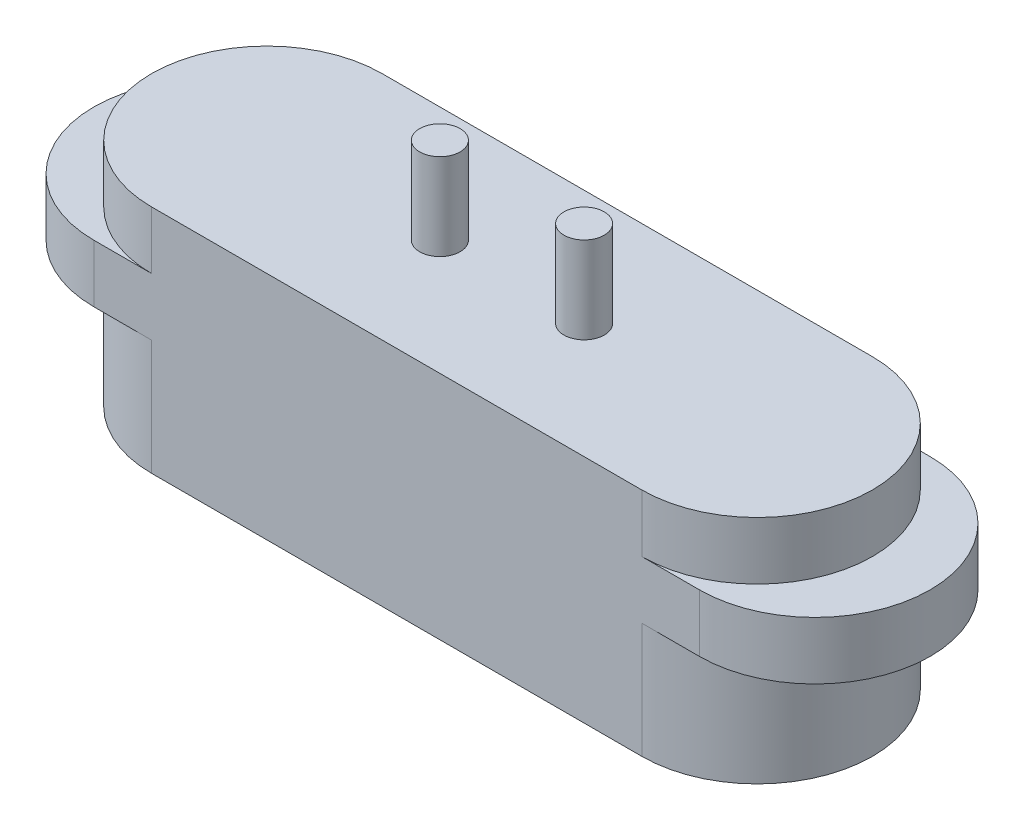
ISO-10303-21;
HEADER;
FILE_DESCRIPTION(('STEP AP214'),'2;1');
FILE_NAME('part.step','',(''),(''),'','','');
FILE_SCHEMA(('AUTOMOTIVE_DESIGN { 1 0 10303 214 1 1 1 1 }'));
ENDSEC;
DATA;
#1=APPLICATION_CONTEXT('core data for automotive mechanical design processes');
#2=APPLICATION_PROTOCOL_DEFINITION('international standard','automotive_design',2000,#1);
#3=PRODUCT_CONTEXT('',#1,'mechanical');
#4=PRODUCT('Part','Part','',(#3));
#5=PRODUCT_RELATED_PRODUCT_CATEGORY('part','',(#4));
#6=PRODUCT_DEFINITION_FORMATION('','',#4);
#7=PRODUCT_DEFINITION_CONTEXT('part definition',#1,'design');
#8=PRODUCT_DEFINITION('design','',#6,#7);
#9=PRODUCT_DEFINITION_SHAPE('','',#8);
#10=(LENGTH_UNIT() NAMED_UNIT(*) SI_UNIT(.MILLI.,.METRE.));
#11=(NAMED_UNIT(*) PLANE_ANGLE_UNIT() SI_UNIT($,.RADIAN.));
#12=(NAMED_UNIT(*) SI_UNIT($,.STERADIAN.) SOLID_ANGLE_UNIT());
#13=UNCERTAINTY_MEASURE_WITH_UNIT(LENGTH_MEASURE(1.E-05),#10,'distance_accuracy_value','');
#14=(GEOMETRIC_REPRESENTATION_CONTEXT(3) GLOBAL_UNCERTAINTY_ASSIGNED_CONTEXT((#13)) GLOBAL_UNIT_ASSIGNED_CONTEXT((#10,
#11,#12)) REPRESENTATION_CONTEXT('',''));
#15=CARTESIAN_POINT('',(0.,0.,0.));
#16=DIRECTION('',(0.,0.,1.));
#17=DIRECTION('',(1.,0.,0.));
#18=AXIS2_PLACEMENT_3D('',#15,#16,#17);
#19=CARTESIAN_POINT('',(-4.25,4.,0.));
#20=DIRECTION('',(0.,-1.,0.));
#21=DIRECTION('',(0.,0.,-1.));
#22=AXIS2_PLACEMENT_3D('',#19,#20,#21);
#23=CYLINDRICAL_SURFACE('',#22,2.);
#24=CARTESIAN_POINT('',(-4.25,2.,0.));
#25=DIRECTION('',(0.,1.,0.));
#26=DIRECTION('',(0.,0.,1.));
#27=AXIS2_PLACEMENT_3D('',#24,#25,#26);
#28=CIRCLE('',#27,2.);
#29=CARTESIAN_POINT('',(-4.25,2.,-2.));
#30=VERTEX_POINT('',#29);
#31=CARTESIAN_POINT('',(-4.25,2.,2.));
#32=VERTEX_POINT('',#31);
#33=EDGE_CURVE('E67',#30,#32,#28,.T.);
#34=ORIENTED_EDGE('',*,*,#33,.F.);
#35=DIRECTION('',(0.,-1.,0.));
#36=VECTOR('',#35,1.);
#37=CARTESIAN_POINT('',(-4.25,4.,-2.));
#38=LINE('',#37,#36);
#39=CARTESIAN_POINT('',(-4.25,0.,-2.));
#40=VERTEX_POINT('',#39);
#41=EDGE_CURVE('E259',#30,#40,#38,.T.);
#42=ORIENTED_EDGE('',*,*,#41,.T.);
#43=CARTESIAN_POINT('',(-4.25,0.,0.));
#44=DIRECTION('',(0.,1.,0.));
#45=DIRECTION('',(0.,0.,1.));
#46=AXIS2_PLACEMENT_3D('',#43,#44,#45);
#47=CIRCLE('',#46,2.);
#48=CARTESIAN_POINT('',(-4.25,0.,2.));
#49=VERTEX_POINT('',#48);
#50=EDGE_CURVE('E230',#40,#49,#47,.T.);
#51=ORIENTED_EDGE('',*,*,#50,.T.);
#52=DIRECTION('',(0.,-1.,0.));
#53=VECTOR('',#52,1.);
#54=CARTESIAN_POINT('',(-4.25,4.,2.));
#55=LINE('',#54,#53);
#56=EDGE_CURVE('E240',#32,#49,#55,.T.);
#57=ORIENTED_EDGE('',*,*,#56,.F.);
#58=EDGE_LOOP('',(#34,#42,#51,#57));
#59=FACE_BOUND('',#58,.T.);
#60=ADVANCED_FACE('F51',(#59),#23,.T.);
#61=CARTESIAN_POINT('',(4.25,4.,0.));
#62=DIRECTION('',(0.,-1.,0.));
#63=DIRECTION('',(0.,0.,-1.));
#64=AXIS2_PLACEMENT_3D('',#61,#62,#63);
#65=CYLINDRICAL_SURFACE('',#64,2.);
#66=CARTESIAN_POINT('',(4.25,2.,0.));
#67=DIRECTION('',(0.,1.,0.));
#68=DIRECTION('',(0.,0.,1.));
#69=AXIS2_PLACEMENT_3D('',#66,#67,#68);
#70=CIRCLE('',#69,2.);
#71=CARTESIAN_POINT('',(4.25,2.,2.));
#72=VERTEX_POINT('',#71);
#73=CARTESIAN_POINT('',(4.25,2.,-2.));
#74=VERTEX_POINT('',#73);
#75=EDGE_CURVE('E152',#72,#74,#70,.T.);
#76=ORIENTED_EDGE('',*,*,#75,.F.);
#77=DIRECTION('',(0.,-1.,0.));
#78=VECTOR('',#77,1.);
#79=CARTESIAN_POINT('',(4.25,4.,2.));
#80=LINE('',#79,#78);
#81=CARTESIAN_POINT('',(4.25,0.,2.));
#82=VERTEX_POINT('',#81);
#83=EDGE_CURVE('E60',#72,#82,#80,.T.);
#84=ORIENTED_EDGE('',*,*,#83,.T.);
#85=CARTESIAN_POINT('',(4.25,0.,0.));
#86=DIRECTION('',(0.,1.,0.));
#87=DIRECTION('',(0.,0.,1.));
#88=AXIS2_PLACEMENT_3D('',#85,#86,#87);
#89=CIRCLE('',#88,2.);
#90=CARTESIAN_POINT('',(4.25,0.,-2.));
#91=VERTEX_POINT('',#90);
#92=EDGE_CURVE('E244',#82,#91,#89,.T.);
#93=ORIENTED_EDGE('',*,*,#92,.T.);
#94=DIRECTION('',(0.,-1.,0.));
#95=VECTOR('',#94,1.);
#96=CARTESIAN_POINT('',(4.25,4.,-2.));
#97=LINE('',#96,#95);
#98=EDGE_CURVE('E261',#74,#91,#97,.T.);
#99=ORIENTED_EDGE('',*,*,#98,.F.);
#100=EDGE_LOOP('',(#76,#84,#93,#99));
#101=FACE_BOUND('',#100,.T.);
#102=ADVANCED_FACE('F272',(#101),#65,.T.);
#103=CARTESIAN_POINT('',(0.,4.,2.));
#104=DIRECTION('',(0.,0.,-1.));
#105=DIRECTION('',(-1.,0.,0.));
#106=AXIS2_PLACEMENT_3D('',#103,#104,#105);
#107=PLANE('',#106);
#108=DIRECTION('',(1.,0.,0.));
#109=VECTOR('',#108,1.);
#110=CARTESIAN_POINT('',(0.,0.,2.));
#111=LINE('',#110,#109);
#112=EDGE_CURVE('E224',#49,#82,#111,.T.);
#113=ORIENTED_EDGE('',*,*,#112,.T.);
#114=ORIENTED_EDGE('',*,*,#83,.F.);
#115=DIRECTION('',(1.,0.,0.));
#116=VECTOR('',#115,1.);
#117=CARTESIAN_POINT('',(0.,2.,2.));
#118=LINE('',#117,#116);
#119=CARTESIAN_POINT('',(5.25,2.,2.));
#120=VERTEX_POINT('',#119);
#121=EDGE_CURVE('E208',#72,#120,#118,.T.);
#122=ORIENTED_EDGE('',*,*,#121,.T.);
#123=DIRECTION('',(0.,-1.,0.));
#124=VECTOR('',#123,1.);
#125=CARTESIAN_POINT('',(5.25,3.,2.));
#126=LINE('',#125,#124);
#127=CARTESIAN_POINT('',(5.25,3.,2.));
#128=VERTEX_POINT('',#127);
#129=EDGE_CURVE('E220',#128,#120,#126,.T.);
#130=ORIENTED_EDGE('',*,*,#129,.F.);
#131=DIRECTION('',(1.,0.,0.));
#132=VECTOR('',#131,1.);
#133=CARTESIAN_POINT('',(0.,3.,2.));
#134=LINE('',#133,#132);
#135=CARTESIAN_POINT('',(4.25,3.,2.));
#136=VERTEX_POINT('',#135);
#137=EDGE_CURVE('E193',#136,#128,#134,.T.);
#138=ORIENTED_EDGE('',*,*,#137,.F.);
#139=CARTESIAN_POINT('',(4.25,4.,2.));
#140=VERTEX_POINT('',#139);
#141=EDGE_CURVE('E11',#140,#136,#80,.T.);
#142=ORIENTED_EDGE('',*,*,#141,.F.);
#143=DIRECTION('',(1.,0.,0.));
#144=VECTOR('',#143,1.);
#145=CARTESIAN_POINT('',(0.,4.,2.));
#146=LINE('',#145,#144);
#147=CARTESIAN_POINT('',(-4.25,4.,2.));
#148=VERTEX_POINT('',#147);
#149=EDGE_CURVE('E225',#148,#140,#146,.T.);
#150=ORIENTED_EDGE('',*,*,#149,.F.);
#151=CARTESIAN_POINT('',(-4.25,3.,2.));
#152=VERTEX_POINT('',#151);
#153=EDGE_CURVE('E255',#148,#152,#55,.T.);
#154=ORIENTED_EDGE('',*,*,#153,.T.);
#155=DIRECTION('',(1.,0.,0.));
#156=VECTOR('',#155,1.);
#157=CARTESIAN_POINT('',(0.,3.,2.));
#158=LINE('',#157,#156);
#159=CARTESIAN_POINT('',(-5.25,3.,2.));
#160=VERTEX_POINT('',#159);
#161=EDGE_CURVE('E163',#160,#152,#158,.T.);
#162=ORIENTED_EDGE('',*,*,#161,.F.);
#163=DIRECTION('',(0.,-1.,0.));
#164=VECTOR('',#163,1.);
#165=CARTESIAN_POINT('',(-5.25,3.,2.));
#166=LINE('',#165,#164);
#167=CARTESIAN_POINT('',(-5.25,2.,2.));
#168=VERTEX_POINT('',#167);
#169=EDGE_CURVE('E153',#160,#168,#166,.T.);
#170=ORIENTED_EDGE('',*,*,#169,.T.);
#171=DIRECTION('',(1.,0.,0.));
#172=VECTOR('',#171,1.);
#173=CARTESIAN_POINT('',(0.,2.,2.));
#174=LINE('',#173,#172);
#175=EDGE_CURVE('E170',#168,#32,#174,.T.);
#176=ORIENTED_EDGE('',*,*,#175,.T.);
#177=ORIENTED_EDGE('',*,*,#56,.T.);
#178=EDGE_LOOP('',(#113,#114,#122,#130,#138,#142,#150,#154,#162,#170,#176,#177));
#179=FACE_BOUND('',#178,.T.);
#180=ADVANCED_FACE('F53',(#179),#107,.F.);
#181=ORIENTED_EDGE('',*,*,#141,.T.);
#182=CARTESIAN_POINT('',(4.25,3.,0.));
#183=DIRECTION('',(0.,1.,0.));
#184=DIRECTION('',(0.,0.,1.));
#185=AXIS2_PLACEMENT_3D('',#182,#183,#184);
#186=CIRCLE('',#185,2.);
#187=CARTESIAN_POINT('',(4.25,3.,-2.));
#188=VERTEX_POINT('',#187);
#189=EDGE_CURVE('E189',#136,#188,#186,.T.);
#190=ORIENTED_EDGE('',*,*,#189,.T.);
#191=CARTESIAN_POINT('',(4.25,4.,-2.));
#192=VERTEX_POINT('',#191);
#193=EDGE_CURVE('E262',#192,#188,#97,.T.);
#194=ORIENTED_EDGE('',*,*,#193,.F.);
#195=CARTESIAN_POINT('',(4.25,4.,0.));
#196=DIRECTION('',(0.,1.,0.));
#197=DIRECTION('',(0.,0.,1.));
#198=AXIS2_PLACEMENT_3D('',#195,#196,#197);
#199=CIRCLE('',#198,2.);
#200=EDGE_CURVE('E229',#140,#192,#199,.T.);
#201=ORIENTED_EDGE('',*,*,#200,.F.);
#202=EDGE_LOOP('',(#181,#190,#194,#201));
#203=FACE_BOUND('',#202,.T.);
#204=ADVANCED_FACE('F303',(#203),#65,.T.);
#205=CARTESIAN_POINT('',(0.,4.,-2.));
#206=DIRECTION('',(0.,0.,-1.));
#207=DIRECTION('',(-1.,0.,0.));
#208=AXIS2_PLACEMENT_3D('',#205,#206,#207);
#209=PLANE('',#208);
#210=DIRECTION('',(1.,0.,0.));
#211=VECTOR('',#210,1.);
#212=CARTESIAN_POINT('',(0.,0.,-2.));
#213=LINE('',#212,#211);
#214=EDGE_CURVE('E248',#40,#91,#213,.T.);
#215=ORIENTED_EDGE('',*,*,#214,.F.);
#216=ORIENTED_EDGE('',*,*,#41,.F.);
#217=DIRECTION('',(1.,0.,0.));
#218=VECTOR('',#217,1.);
#219=CARTESIAN_POINT('',(0.,2.,-2.));
#220=LINE('',#219,#218);
#221=CARTESIAN_POINT('',(-5.25,2.,-2.));
#222=VERTEX_POINT('',#221);
#223=EDGE_CURVE('E148',#222,#30,#220,.T.);
#224=ORIENTED_EDGE('',*,*,#223,.F.);
#225=DIRECTION('',(0.,-1.,0.));
#226=VECTOR('',#225,1.);
#227=CARTESIAN_POINT('',(-5.25,3.,-2.));
#228=LINE('',#227,#226);
#229=CARTESIAN_POINT('',(-5.25,3.,-2.));
#230=VERTEX_POINT('',#229);
#231=EDGE_CURVE('E141',#230,#222,#228,.T.);
#232=ORIENTED_EDGE('',*,*,#231,.F.);
#233=DIRECTION('',(1.,0.,0.));
#234=VECTOR('',#233,1.);
#235=CARTESIAN_POINT('',(0.,3.,-2.));
#236=LINE('',#235,#234);
#237=CARTESIAN_POINT('',(-4.25,3.,-2.));
#238=VERTEX_POINT('',#237);
#239=EDGE_CURVE('E146',#230,#238,#236,.T.);
#240=ORIENTED_EDGE('',*,*,#239,.T.);
#241=CARTESIAN_POINT('',(-4.25,4.,-2.));
#242=VERTEX_POINT('',#241);
#243=EDGE_CURVE('E75',#242,#238,#38,.T.);
#244=ORIENTED_EDGE('',*,*,#243,.F.);
#245=DIRECTION('',(1.,0.,0.));
#246=VECTOR('',#245,1.);
#247=CARTESIAN_POINT('',(0.,4.,-2.));
#248=LINE('',#247,#246);
#249=EDGE_CURVE('E233',#242,#192,#248,.T.);
#250=ORIENTED_EDGE('',*,*,#249,.T.);
#251=ORIENTED_EDGE('',*,*,#193,.T.);
#252=DIRECTION('',(1.,0.,0.));
#253=VECTOR('',#252,1.);
#254=CARTESIAN_POINT('',(0.,3.,-2.));
#255=LINE('',#254,#253);
#256=CARTESIAN_POINT('',(5.25,3.,-2.));
#257=VERTEX_POINT('',#256);
#258=EDGE_CURVE('E200',#188,#257,#255,.T.);
#259=ORIENTED_EDGE('',*,*,#258,.T.);
#260=DIRECTION('',(0.,-1.,0.));
#261=VECTOR('',#260,1.);
#262=CARTESIAN_POINT('',(5.25,3.,-2.));
#263=LINE('',#262,#261);
#264=CARTESIAN_POINT('',(5.25,2.,-2.));
#265=VERTEX_POINT('',#264);
#266=EDGE_CURVE('E204',#257,#265,#263,.T.);
#267=ORIENTED_EDGE('',*,*,#266,.T.);
#268=DIRECTION('',(1.,0.,0.));
#269=VECTOR('',#268,1.);
#270=CARTESIAN_POINT('',(0.,2.,-2.));
#271=LINE('',#270,#269);
#272=EDGE_CURVE('E194',#74,#265,#271,.T.);
#273=ORIENTED_EDGE('',*,*,#272,.F.);
#274=ORIENTED_EDGE('',*,*,#98,.T.);
#275=EDGE_LOOP('',(#215,#216,#224,#232,#240,#244,#250,#251,#259,#267,#273,#274));
#276=FACE_BOUND('',#275,.T.);
#277=ADVANCED_FACE('F144',(#276),#209,.T.);
#278=ORIENTED_EDGE('',*,*,#243,.T.);
#279=CARTESIAN_POINT('',(-4.25,3.,0.));
#280=DIRECTION('',(0.,1.,0.));
#281=DIRECTION('',(0.,0.,1.));
#282=AXIS2_PLACEMENT_3D('',#279,#280,#281);
#283=CIRCLE('',#282,2.);
#284=EDGE_CURVE('E166',#238,#152,#283,.T.);
#285=ORIENTED_EDGE('',*,*,#284,.T.);
#286=ORIENTED_EDGE('',*,*,#153,.F.);
#287=CARTESIAN_POINT('',(-4.25,4.,0.));
#288=DIRECTION('',(0.,1.,0.));
#289=DIRECTION('',(0.,0.,1.));
#290=AXIS2_PLACEMENT_3D('',#287,#288,#289);
#291=CIRCLE('',#290,2.);
#292=EDGE_CURVE('E237',#242,#148,#291,.T.);
#293=ORIENTED_EDGE('',*,*,#292,.F.);
#294=EDGE_LOOP('',(#278,#285,#286,#293));
#295=FACE_BOUND('',#294,.T.);
#296=ADVANCED_FACE('F299',(#295),#23,.T.);
#297=CARTESIAN_POINT('',(0.,4.,0.));
#298=DIRECTION('',(0.,1.,0.));
#299=DIRECTION('',(0.,0.,1.));
#300=AXIS2_PLACEMENT_3D('',#297,#298,#299);
#301=PLANE('',#300);
#302=CARTESIAN_POINT('',(1.25,4.,0.));
#303=DIRECTION('',(0.,1.,0.));
#304=DIRECTION('',(0.,0.,1.));
#305=AXIS2_PLACEMENT_3D('',#302,#303,#304);
#306=CIRCLE('',#305,0.35);
#307=CARTESIAN_POINT('',(1.25,4.,0.35));
#308=VERTEX_POINT('',#307);
#309=EDGE_CURVE('E376',#308,#308,#306,.T.);
#310=ORIENTED_EDGE('',*,*,#309,.F.);
#311=EDGE_LOOP('',(#310));
#312=FACE_BOUND('',#311,.T.);
#313=CARTESIAN_POINT('',(-1.25,4.,0.));
#314=DIRECTION('',(0.,1.,0.));
#315=DIRECTION('',(0.,0.,1.));
#316=AXIS2_PLACEMENT_3D('',#313,#314,#315);
#317=CIRCLE('',#316,0.35);
#318=CARTESIAN_POINT('',(-1.25,4.,0.35));
#319=VERTEX_POINT('',#318);
#320=EDGE_CURVE('E380',#319,#319,#317,.T.);
#321=ORIENTED_EDGE('',*,*,#320,.F.);
#322=EDGE_LOOP('',(#321));
#323=FACE_BOUND('',#322,.T.);
#324=ORIENTED_EDGE('',*,*,#149,.T.);
#325=ORIENTED_EDGE('',*,*,#200,.T.);
#326=ORIENTED_EDGE('',*,*,#249,.F.);
#327=ORIENTED_EDGE('',*,*,#292,.T.);
#328=EDGE_LOOP('',(#324,#325,#326,#327));
#329=FACE_BOUND('',#328,.T.);
#330=ADVANCED_FACE('F307',(#312,#323,#329),#301,.T.);
#331=CARTESIAN_POINT('',(0.,0.,0.));
#332=DIRECTION('',(0.,1.,0.));
#333=DIRECTION('',(0.,0.,1.));
#334=AXIS2_PLACEMENT_3D('',#331,#332,#333);
#335=PLANE('',#334);
#336=CARTESIAN_POINT('',(-4.25,0.,0.));
#337=DIRECTION('',(0.,-1.,0.));
#338=DIRECTION('',(0.,0.,-1.));
#339=AXIS2_PLACEMENT_3D('',#336,#337,#338);
#340=CIRCLE('',#339,1.25);
#341=CARTESIAN_POINT('',(-4.25,0.,-1.25));
#342=VERTEX_POINT('',#341);
#343=EDGE_CURVE('E351',#342,#342,#340,.T.);
#344=ORIENTED_EDGE('',*,*,#343,.F.);
#345=EDGE_LOOP('',(#344));
#346=FACE_BOUND('',#345,.T.);
#347=CARTESIAN_POINT('',(4.25,0.,0.));
#348=DIRECTION('',(0.,-1.,0.));
#349=DIRECTION('',(0.,0.,-1.));
#350=AXIS2_PLACEMENT_3D('',#347,#348,#349);
#351=CIRCLE('',#350,1.25);
#352=CARTESIAN_POINT('',(4.25,0.,-1.25));
#353=VERTEX_POINT('',#352);
#354=EDGE_CURVE('E355',#353,#353,#351,.T.);
#355=ORIENTED_EDGE('',*,*,#354,.F.);
#356=EDGE_LOOP('',(#355));
#357=FACE_BOUND('',#356,.T.);
#358=CARTESIAN_POINT('',(1.25,0.,0.));
#359=DIRECTION('',(0.,-1.,0.));
#360=DIRECTION('',(0.,0.,-1.));
#361=AXIS2_PLACEMENT_3D('',#358,#359,#360);
#362=CIRCLE('',#361,0.75);
#363=CARTESIAN_POINT('',(1.25,0.,-0.750000000000001));
#364=VERTEX_POINT('',#363);
#365=EDGE_CURVE('E359',#364,#364,#362,.T.);
#366=ORIENTED_EDGE('',*,*,#365,.F.);
#367=EDGE_LOOP('',(#366));
#368=FACE_BOUND('',#367,.T.);
#369=CARTESIAN_POINT('',(-1.25,0.,0.));
#370=DIRECTION('',(0.,-1.,0.));
#371=DIRECTION('',(0.,0.,-1.));
#372=AXIS2_PLACEMENT_3D('',#369,#370,#371);
#373=CIRCLE('',#372,0.75);
#374=CARTESIAN_POINT('',(-1.25,0.,-0.75));
#375=VERTEX_POINT('',#374);
#376=EDGE_CURVE('E362',#375,#375,#373,.T.);
#377=ORIENTED_EDGE('',*,*,#376,.F.);
#378=EDGE_LOOP('',(#377));
#379=FACE_BOUND('',#378,.T.);
#380=ORIENTED_EDGE('',*,*,#112,.F.);
#381=ORIENTED_EDGE('',*,*,#50,.F.);
#382=ORIENTED_EDGE('',*,*,#214,.T.);
#383=ORIENTED_EDGE('',*,*,#92,.F.);
#384=EDGE_LOOP('',(#380,#381,#382,#383));
#385=FACE_BOUND('',#384,.T.);
#386=ADVANCED_FACE('F277',(#346,#357,#368,#379,#385),#335,.F.);
#387=CARTESIAN_POINT('',(5.25,3.,0.));
#388=DIRECTION('',(0.,-1.,0.));
#389=DIRECTION('',(0.,0.,-1.));
#390=AXIS2_PLACEMENT_3D('',#387,#388,#389);
#391=CYLINDRICAL_SURFACE('',#390,2.);
#392=CARTESIAN_POINT('',(5.25,2.,0.));
#393=DIRECTION('',(0.,1.,0.));
#394=DIRECTION('',(0.,0.,1.));
#395=AXIS2_PLACEMENT_3D('',#392,#393,#394);
#396=CIRCLE('',#395,2.);
#397=EDGE_CURVE('E211',#120,#265,#396,.T.);
#398=ORIENTED_EDGE('',*,*,#397,.T.);
#399=ORIENTED_EDGE('',*,*,#266,.F.);
#400=CARTESIAN_POINT('',(5.25,3.,0.));
#401=DIRECTION('',(0.,1.,0.));
#402=DIRECTION('',(0.,0.,1.));
#403=AXIS2_PLACEMENT_3D('',#400,#401,#402);
#404=CIRCLE('',#403,2.);
#405=EDGE_CURVE('E197',#128,#257,#404,.T.);
#406=ORIENTED_EDGE('',*,*,#405,.F.);
#407=ORIENTED_EDGE('',*,*,#129,.T.);
#408=EDGE_LOOP('',(#398,#399,#406,#407));
#409=FACE_BOUND('',#408,.T.);
#410=ADVANCED_FACE('F331',(#409),#391,.T.);
#411=CARTESIAN_POINT('',(0.,3.,0.));
#412=DIRECTION('',(0.,1.,0.));
#413=DIRECTION('',(0.,0.,1.));
#414=AXIS2_PLACEMENT_3D('',#411,#412,#413);
#415=PLANE('',#414);
#416=ORIENTED_EDGE('',*,*,#189,.F.);
#417=ORIENTED_EDGE('',*,*,#137,.T.);
#418=ORIENTED_EDGE('',*,*,#405,.T.);
#419=ORIENTED_EDGE('',*,*,#258,.F.);
#420=EDGE_LOOP('',(#416,#417,#418,#419));
#421=FACE_BOUND('',#420,.T.);
#422=ADVANCED_FACE('F327',(#421),#415,.T.);
#423=CARTESIAN_POINT('',(0.,2.,0.));
#424=DIRECTION('',(0.,1.,0.));
#425=DIRECTION('',(0.,0.,1.));
#426=AXIS2_PLACEMENT_3D('',#423,#424,#425);
#427=PLANE('',#426);
#428=ORIENTED_EDGE('',*,*,#75,.T.);
#429=ORIENTED_EDGE('',*,*,#272,.T.);
#430=ORIENTED_EDGE('',*,*,#397,.F.);
#431=ORIENTED_EDGE('',*,*,#121,.F.);
#432=EDGE_LOOP('',(#428,#429,#430,#431));
#433=FACE_BOUND('',#432,.T.);
#434=ADVANCED_FACE('F333',(#433),#427,.F.);
#435=CARTESIAN_POINT('',(-5.25,3.,0.));
#436=DIRECTION('',(0.,-1.,0.));
#437=DIRECTION('',(0.,0.,-1.));
#438=AXIS2_PLACEMENT_3D('',#435,#436,#437);
#439=CYLINDRICAL_SURFACE('',#438,2.);
#440=CARTESIAN_POINT('',(-5.25,2.,0.));
#441=DIRECTION('',(0.,1.,0.));
#442=DIRECTION('',(0.,0.,1.));
#443=AXIS2_PLACEMENT_3D('',#440,#441,#442);
#444=CIRCLE('',#443,2.);
#445=EDGE_CURVE('E181',#222,#168,#444,.T.);
#446=ORIENTED_EDGE('',*,*,#445,.T.);
#447=ORIENTED_EDGE('',*,*,#169,.F.);
#448=CARTESIAN_POINT('',(-5.25,3.,0.));
#449=DIRECTION('',(0.,1.,0.));
#450=DIRECTION('',(0.,0.,1.));
#451=AXIS2_PLACEMENT_3D('',#448,#449,#450);
#452=CIRCLE('',#451,2.);
#453=EDGE_CURVE('E156',#230,#160,#452,.T.);
#454=ORIENTED_EDGE('',*,*,#453,.F.);
#455=ORIENTED_EDGE('',*,*,#231,.T.);
#456=EDGE_LOOP('',(#446,#447,#454,#455));
#457=FACE_BOUND('',#456,.T.);
#458=ADVANCED_FACE('F157',(#457),#439,.T.);
#459=CARTESIAN_POINT('',(0.,3.,0.));
#460=DIRECTION('',(0.,1.,0.));
#461=DIRECTION('',(0.,0.,1.));
#462=AXIS2_PLACEMENT_3D('',#459,#460,#461);
#463=PLANE('',#462);
#464=ORIENTED_EDGE('',*,*,#284,.F.);
#465=ORIENTED_EDGE('',*,*,#239,.F.);
#466=ORIENTED_EDGE('',*,*,#453,.T.);
#467=ORIENTED_EDGE('',*,*,#161,.T.);
#468=EDGE_LOOP('',(#464,#465,#466,#467));
#469=FACE_BOUND('',#468,.T.);
#470=ADVANCED_FACE('F165',(#469),#463,.T.);
#471=CARTESIAN_POINT('',(0.,2.,0.));
#472=DIRECTION('',(0.,1.,0.));
#473=DIRECTION('',(0.,0.,1.));
#474=AXIS2_PLACEMENT_3D('',#471,#472,#473);
#475=PLANE('',#474);
#476=ORIENTED_EDGE('',*,*,#33,.T.);
#477=ORIENTED_EDGE('',*,*,#175,.F.);
#478=ORIENTED_EDGE('',*,*,#445,.F.);
#479=ORIENTED_EDGE('',*,*,#223,.T.);
#480=EDGE_LOOP('',(#476,#477,#478,#479));
#481=FACE_BOUND('',#480,.T.);
#482=ADVANCED_FACE('F283',(#481),#475,.F.);
#483=CARTESIAN_POINT('',(-1.25,5.5,0.));
#484=DIRECTION('',(0.,-1.,0.));
#485=DIRECTION('',(0.,0.,-1.));
#486=AXIS2_PLACEMENT_3D('',#483,#484,#485);
#487=CYLINDRICAL_SURFACE('',#486,0.35);
#488=CARTESIAN_POINT('',(-1.25,5.5,0.));
#489=DIRECTION('',(0.,1.,0.));
#490=DIRECTION('',(0.,0.,1.));
#491=AXIS2_PLACEMENT_3D('',#488,#489,#490);
#492=CIRCLE('',#491,0.35);
#493=CARTESIAN_POINT('',(-1.25,5.5,0.35));
#494=VERTEX_POINT('',#493);
#495=EDGE_CURVE('E178',#494,#494,#492,.T.);
#496=ORIENTED_EDGE('',*,*,#495,.F.);
#497=EDGE_LOOP('',(#496));
#498=FACE_BOUND('',#497,.T.);
#499=ORIENTED_EDGE('',*,*,#320,.T.);
#500=EDGE_LOOP('',(#499));
#501=FACE_BOUND('',#500,.T.);
#502=ADVANCED_FACE('F285',(#498,#501),#487,.T.);
#503=CARTESIAN_POINT('',(-1.25,5.5,0.));
#504=DIRECTION('',(0.,1.,0.));
#505=DIRECTION('',(0.,0.,1.));
#506=AXIS2_PLACEMENT_3D('',#503,#504,#505);
#507=PLANE('',#506);
#508=ORIENTED_EDGE('',*,*,#495,.T.);
#509=EDGE_LOOP('',(#508));
#510=FACE_BOUND('',#509,.T.);
#511=ADVANCED_FACE('F292',(#510),#507,.T.);
#512=CARTESIAN_POINT('',(1.25,5.5,0.));
#513=DIRECTION('',(0.,-1.,0.));
#514=DIRECTION('',(0.,0.,-1.));
#515=AXIS2_PLACEMENT_3D('',#512,#513,#514);
#516=CYLINDRICAL_SURFACE('',#515,0.35);
#517=CARTESIAN_POINT('',(1.25,5.5,0.));
#518=DIRECTION('',(0.,1.,0.));
#519=DIRECTION('',(0.,0.,1.));
#520=AXIS2_PLACEMENT_3D('',#517,#518,#519);
#521=CIRCLE('',#520,0.35);
#522=CARTESIAN_POINT('',(1.25,5.5,0.35));
#523=VERTEX_POINT('',#522);
#524=EDGE_CURVE('E370',#523,#523,#521,.T.);
#525=ORIENTED_EDGE('',*,*,#524,.F.);
#526=EDGE_LOOP('',(#525));
#527=FACE_BOUND('',#526,.T.);
#528=ORIENTED_EDGE('',*,*,#309,.T.);
#529=EDGE_LOOP('',(#528));
#530=FACE_BOUND('',#529,.T.);
#531=ADVANCED_FACE('F397',(#527,#530),#516,.T.);
#532=CARTESIAN_POINT('',(1.25,5.5,0.));
#533=DIRECTION('',(0.,1.,0.));
#534=DIRECTION('',(0.,0.,1.));
#535=AXIS2_PLACEMENT_3D('',#532,#533,#534);
#536=PLANE('',#535);
#537=ORIENTED_EDGE('',*,*,#524,.T.);
#538=EDGE_LOOP('',(#537));
#539=FACE_BOUND('',#538,.T.);
#540=ADVANCED_FACE('F402',(#539),#536,.T.);
#541=CARTESIAN_POINT('',(-1.25,0.01,0.));
#542=DIRECTION('',(0.,-1.,0.));
#543=DIRECTION('',(0.,0.,-1.));
#544=AXIS2_PLACEMENT_3D('',#541,#542,#543);
#545=CYLINDRICAL_SURFACE('',#544,0.75);
#546=CARTESIAN_POINT('',(-1.25,0.01,0.));
#547=DIRECTION('',(0.,-1.,0.));
#548=DIRECTION('',(0.,0.,-1.));
#549=AXIS2_PLACEMENT_3D('',#546,#547,#548);
#550=CIRCLE('',#549,0.75);
#551=CARTESIAN_POINT('',(-1.25,0.01,-0.75));
#552=VERTEX_POINT('',#551);
#553=EDGE_CURVE('E365',#552,#552,#550,.T.);
#554=ORIENTED_EDGE('',*,*,#553,.F.);
#555=EDGE_LOOP('',(#554));
#556=FACE_BOUND('',#555,.T.);
#557=ORIENTED_EDGE('',*,*,#376,.T.);
#558=EDGE_LOOP('',(#557));
#559=FACE_BOUND('',#558,.T.);
#560=ADVANCED_FACE('F407',(#556,#559),#545,.F.);
#561=CARTESIAN_POINT('',(0.,0.01,0.));
#562=DIRECTION('',(0.,-1.,0.));
#563=DIRECTION('',(0.,0.,-1.));
#564=AXIS2_PLACEMENT_3D('',#561,#562,#563);
#565=PLANE('',#564);
#566=ORIENTED_EDGE('',*,*,#553,.T.);
#567=EDGE_LOOP('',(#566));
#568=FACE_BOUND('',#567,.T.);
#569=ADVANCED_FACE('F411',(#568),#565,.T.);
#570=CARTESIAN_POINT('',(1.25,0.01,0.));
#571=DIRECTION('',(0.,-1.,0.));
#572=DIRECTION('',(0.,0.,-1.));
#573=AXIS2_PLACEMENT_3D('',#570,#571,#572);
#574=CYLINDRICAL_SURFACE('',#573,0.75);
#575=CARTESIAN_POINT('',(1.25,0.01,0.));
#576=DIRECTION('',(0.,-1.,0.));
#577=DIRECTION('',(0.,0.,-1.));
#578=AXIS2_PLACEMENT_3D('',#575,#576,#577);
#579=CIRCLE('',#578,0.75);
#580=CARTESIAN_POINT('',(1.25,0.01,-0.750000000000001));
#581=VERTEX_POINT('',#580);
#582=EDGE_CURVE('E372',#581,#581,#579,.T.);
#583=ORIENTED_EDGE('',*,*,#582,.F.);
#584=EDGE_LOOP('',(#583));
#585=FACE_BOUND('',#584,.T.);
#586=ORIENTED_EDGE('',*,*,#365,.T.);
#587=EDGE_LOOP('',(#586));
#588=FACE_BOUND('',#587,.T.);
#589=ADVANCED_FACE('F415',(#585,#588),#574,.F.);
#590=CARTESIAN_POINT('',(0.,0.01,0.));
#591=DIRECTION('',(0.,-1.,0.));
#592=DIRECTION('',(0.,0.,-1.));
#593=AXIS2_PLACEMENT_3D('',#590,#591,#592);
#594=PLANE('',#593);
#595=ORIENTED_EDGE('',*,*,#582,.T.);
#596=EDGE_LOOP('',(#595));
#597=FACE_BOUND('',#596,.T.);
#598=ADVANCED_FACE('F432',(#597),#594,.T.);
#599=CARTESIAN_POINT('',(4.25,0.01,0.));
#600=DIRECTION('',(0.,-1.,0.));
#601=DIRECTION('',(0.,0.,-1.));
#602=AXIS2_PLACEMENT_3D('',#599,#600,#601);
#603=CYLINDRICAL_SURFACE('',#602,1.25);
#604=CARTESIAN_POINT('',(4.25,0.01,0.));
#605=DIRECTION('',(0.,-1.,0.));
#606=DIRECTION('',(0.,0.,-1.));
#607=AXIS2_PLACEMENT_3D('',#604,#605,#606);
#608=CIRCLE('',#607,1.25);
#609=CARTESIAN_POINT('',(4.25,0.01,-1.25));
#610=VERTEX_POINT('',#609);
#611=EDGE_CURVE('E449',#610,#610,#608,.T.);
#612=ORIENTED_EDGE('',*,*,#611,.F.);
#613=EDGE_LOOP('',(#612));
#614=FACE_BOUND('',#613,.T.);
#615=ORIENTED_EDGE('',*,*,#354,.T.);
#616=EDGE_LOOP('',(#615));
#617=FACE_BOUND('',#616,.T.);
#618=ADVANCED_FACE('F428',(#614,#617),#603,.F.);
#619=CARTESIAN_POINT('',(0.,0.01,0.));
#620=DIRECTION('',(0.,-1.,0.));
#621=DIRECTION('',(0.,0.,-1.));
#622=AXIS2_PLACEMENT_3D('',#619,#620,#621);
#623=PLANE('',#622);
#624=ORIENTED_EDGE('',*,*,#611,.T.);
#625=EDGE_LOOP('',(#624));
#626=FACE_BOUND('',#625,.T.);
#627=ADVANCED_FACE('F424',(#626),#623,.T.);
#628=CARTESIAN_POINT('',(-4.25,0.01,0.));
#629=DIRECTION('',(0.,-1.,0.));
#630=DIRECTION('',(0.,0.,-1.));
#631=AXIS2_PLACEMENT_3D('',#628,#629,#630);
#632=CYLINDRICAL_SURFACE('',#631,1.25);
#633=CARTESIAN_POINT('',(-4.25,0.01,0.));
#634=DIRECTION('',(0.,-1.,0.));
#635=DIRECTION('',(0.,0.,-1.));
#636=AXIS2_PLACEMENT_3D('',#633,#634,#635);
#637=CIRCLE('',#636,1.25);
#638=CARTESIAN_POINT('',(-4.25,0.01,-1.25));
#639=VERTEX_POINT('',#638);
#640=EDGE_CURVE('E456',#639,#639,#637,.T.);
#641=ORIENTED_EDGE('',*,*,#640,.F.);
#642=EDGE_LOOP('',(#641));
#643=FACE_BOUND('',#642,.T.);
#644=ORIENTED_EDGE('',*,*,#343,.T.);
#645=EDGE_LOOP('',(#644));
#646=FACE_BOUND('',#645,.T.);
#647=ADVANCED_FACE('F420',(#643,#646),#632,.F.);
#648=CARTESIAN_POINT('',(-4.25,0.01,0.));
#649=DIRECTION('',(0.,-1.,0.));
#650=DIRECTION('',(0.,0.,-1.));
#651=AXIS2_PLACEMENT_3D('',#648,#649,#650);
#652=PLANE('',#651);
#653=ORIENTED_EDGE('',*,*,#640,.T.);
#654=EDGE_LOOP('',(#653));
#655=FACE_BOUND('',#654,.T.);
#656=ADVANCED_FACE('F417',(#655),#652,.T.);
#657=CLOSED_SHELL('',(#60,#102,#180,#204,#277,#296,#330,#386,#410,#422,#434,#458,#470,#482,#502,
#511,#531,#540,#560,#569,#589,#598,#618,#627,#647,#656));
#658=MANIFOLD_SOLID_BREP('B2',#657);
#659=ADVANCED_BREP_SHAPE_REPRESENTATION('',(#18,#658),#14);
#660=SHAPE_DEFINITION_REPRESENTATION(#9,#659);
ENDSEC;
END-ISO-10303-21;
